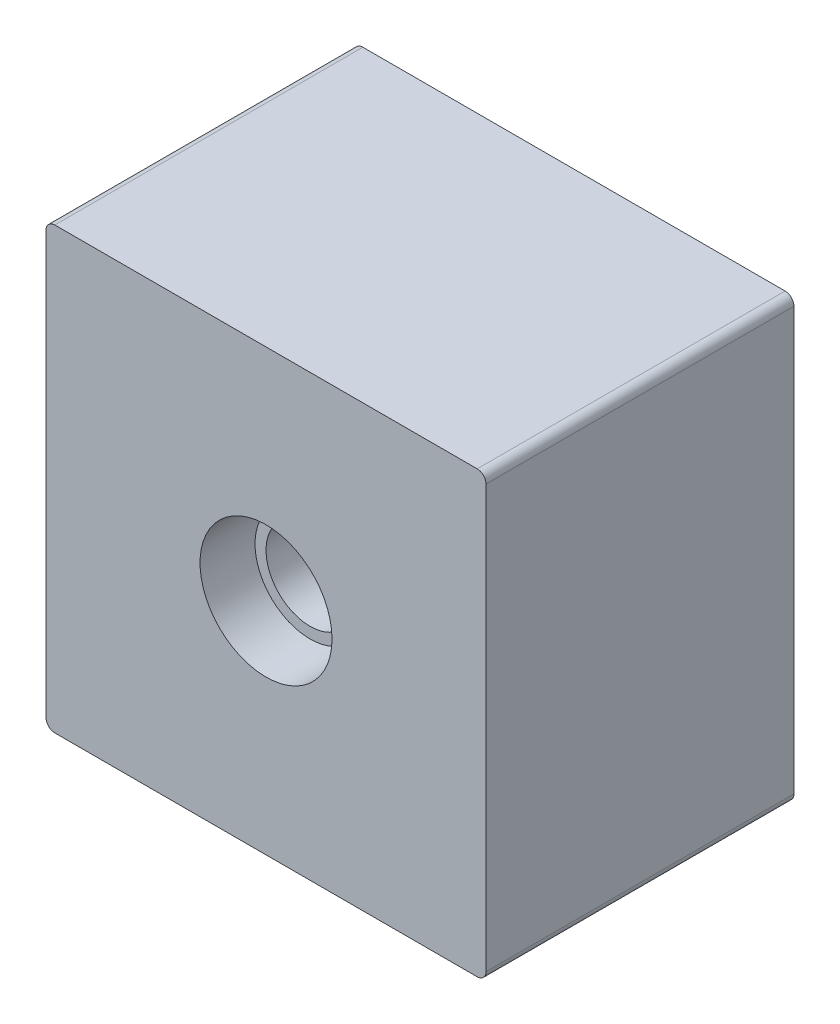
ISO-10303-21;
HEADER;
FILE_DESCRIPTION(('STEP AP214'),'2;1');
FILE_NAME('part.step','',(''),(''),'','','');
FILE_SCHEMA(('AUTOMOTIVE_DESIGN { 1 0 10303 214 1 1 1 1 }'));
ENDSEC;
DATA;
#1=APPLICATION_CONTEXT('core data for automotive mechanical design processes');
#2=APPLICATION_PROTOCOL_DEFINITION('international standard','automotive_design',2000,#1);
#3=PRODUCT_CONTEXT('',#1,'mechanical');
#4=PRODUCT('Part','Part','',(#3));
#5=PRODUCT_RELATED_PRODUCT_CATEGORY('part','',(#4));
#6=PRODUCT_DEFINITION_FORMATION('','',#4);
#7=PRODUCT_DEFINITION_CONTEXT('part definition',#1,'design');
#8=PRODUCT_DEFINITION('design','',#6,#7);
#9=PRODUCT_DEFINITION_SHAPE('','',#8);
#10=(LENGTH_UNIT() NAMED_UNIT(*) SI_UNIT(.MILLI.,.METRE.));
#11=(NAMED_UNIT(*) PLANE_ANGLE_UNIT() SI_UNIT($,.RADIAN.));
#12=(NAMED_UNIT(*) SI_UNIT($,.STERADIAN.) SOLID_ANGLE_UNIT());
#13=UNCERTAINTY_MEASURE_WITH_UNIT(LENGTH_MEASURE(1.E-05),#10,'distance_accuracy_value','');
#14=(GEOMETRIC_REPRESENTATION_CONTEXT(3) GLOBAL_UNCERTAINTY_ASSIGNED_CONTEXT((#13)) GLOBAL_UNIT_ASSIGNED_CONTEXT((#10,
#11,#12)) REPRESENTATION_CONTEXT('',''));
#15=CARTESIAN_POINT('',(0.,0.,0.));
#16=DIRECTION('',(0.,0.,1.));
#17=DIRECTION('',(1.,0.,0.));
#18=AXIS2_PLACEMENT_3D('',#15,#16,#17);
#19=CARTESIAN_POINT('',(-1.38777878078145E-13,0.,5.));
#20=DIRECTION('',(0.,0.,1.00000000000001));
#21=DIRECTION('',(0.913545457642609,-0.406736643075791,0.));
#22=AXIS2_PLACEMENT_3D('',#19,#20,#21);
#23=PLANE('',#22);
#24=CARTESIAN_POINT('',(-1.38777878078145E-13,0.,5.));
#25=DIRECTION('',(0.,0.,-1.00000000000001));
#26=DIRECTION('',(0.913545457642609,-0.406736643075791,0.));
#27=AXIS2_PLACEMENT_3D('',#24,#25,#26);
#28=CIRCLE('',#27,0.5);
#29=CARTESIAN_POINT('',(0.120894803534069,0.485164349966531,4.99999999999987));
#30=VERTEX_POINT('',#29);
#31=CARTESIAN_POINT('',(0.279652962989249,0.414480663350328,4.99999999999995));
#32=VERTEX_POINT('',#31);
#33=EDGE_CURVE('E60',#30,#32,#28,.T.);
#34=ORIENTED_EDGE('',*,*,#33,.T.);
#35=DIRECTION('',(0.559305925978558,0.828961326700635,0.));
#36=VECTOR('',#35,1.);
#37=CARTESIAN_POINT('',(0.279652962989249,0.414480663350328,4.99999999999995));
#38=LINE('',#37,#36);
#39=CARTESIAN_POINT('',(0.559305925978526,0.828961326700635,4.99999999999992));
#40=VERTEX_POINT('',#39);
#41=EDGE_CURVE('E71',#32,#40,#38,.T.);
#42=ORIENTED_EDGE('',*,*,#41,.T.);
#43=CARTESIAN_POINT('',(-1.38777878078145E-13,0.,5.));
#44=DIRECTION('',(0.,0.,1.00000000000001));
#45=DIRECTION('',(0.913545457642609,-0.406736643075791,0.));
#46=AXIS2_PLACEMENT_3D('',#43,#44,#45);
#47=CIRCLE('',#46,1.);
#48=CARTESIAN_POINT('',(0.241789607068277,0.970328699933118,4.99999999999998));
#49=VERTEX_POINT('',#48);
#50=EDGE_CURVE('E56',#40,#49,#47,.T.);
#51=ORIENTED_EDGE('',*,*,#50,.T.);
#52=DIRECTION('',(-0.241789607068291,-0.970328699933056,0.));
#53=VECTOR('',#52,1.);
#54=CARTESIAN_POINT('',(0.120894803534069,0.485164349966531,4.99999999999987));
#55=LINE('',#54,#53);
#56=EDGE_CURVE('E12',#49,#30,#55,.T.);
#57=ORIENTED_EDGE('',*,*,#56,.T.);
#58=EDGE_LOOP('',(#34,#42,#51,#57));
#59=FACE_BOUND('',#58,.T.);
#60=ADVANCED_FACE('F51',(#59),#23,.T.);
#61=OPEN_SHELL('',(#60));
#62=SHELL_BASED_SURFACE_MODEL('B2',(#61));
#63=CARTESIAN_POINT('',(-1.38777878078145E-13,0.,5.));
#64=DIRECTION('',(0.,0.,1.00000000000001));
#65=DIRECTION('',(0.669130606358868,-0.74314482547739,0.));
#66=AXIS2_PLACEMENT_3D('',#63,#64,#65);
#67=PLANE('',#66);
#68=CARTESIAN_POINT('',(-1.38777878078145E-13,0.,5.));
#69=DIRECTION('',(0.,0.,-1.00000000000001));
#70=DIRECTION('',(0.669130606358868,-0.74314482547739,0.));
#71=AXIS2_PLACEMENT_3D('',#68,#69,#70);
#72=CIRCLE('',#71,0.5);
#73=CARTESIAN_POINT('',(0.307777017666655,0.394047341567262,5.));
#74=VERTEX_POINT('',#73);
#75=CARTESIAN_POINT('',(0.424060167686008,0.264901819891979,4.99999999999998));
#76=VERTEX_POINT('',#75);
#77=EDGE_CURVE('E116',#74,#76,#72,.T.);
#78=ORIENTED_EDGE('',*,*,#77,.T.);
#79=DIRECTION('',(0.848120335372177,0.529803639783827,0.));
#80=VECTOR('',#79,1.);
#81=CARTESIAN_POINT('',(0.424060167686008,0.264901819891979,4.99999999999998));
#82=LINE('',#81,#80);
#83=CARTESIAN_POINT('',(0.848120335372099,0.529803639783895,4.99999999999999));
#84=VERTEX_POINT('',#83);
#85=EDGE_CURVE('E127',#76,#84,#82,.T.);
#86=ORIENTED_EDGE('',*,*,#85,.T.);
#87=CARTESIAN_POINT('',(-1.38777878078145E-13,0.,5.));
#88=DIRECTION('',(0.,0.,1.00000000000001));
#89=DIRECTION('',(0.669130606358868,-0.74314482547739,0.));
#90=AXIS2_PLACEMENT_3D('',#87,#88,#89);
#91=CIRCLE('',#90,1.);
#92=CARTESIAN_POINT('',(0.615554035333268,0.788094683134559,4.99999999999991));
#93=VERTEX_POINT('',#92);
#94=EDGE_CURVE('E112',#84,#93,#91,.T.);
#95=ORIENTED_EDGE('',*,*,#94,.T.);
#96=DIRECTION('',(-0.615554035333302,-0.788094683134518,0.));
#97=VECTOR('',#96,1.);
#98=CARTESIAN_POINT('',(0.307777017666655,0.394047341567262,5.));
#99=LINE('',#98,#97);
#100=EDGE_CURVE('E49',#93,#74,#99,.T.);
#101=ORIENTED_EDGE('',*,*,#100,.T.);
#102=EDGE_LOOP('',(#78,#86,#95,#101));
#103=FACE_BOUND('',#102,.T.);
#104=ADVANCED_FACE('F107',(#103),#67,.T.);
#105=OPEN_SHELL('',(#104));
#106=SHELL_BASED_SURFACE_MODEL('B6',(#105));
#107=CARTESIAN_POINT('',(-1.38777878078145E-13,0.,5.));
#108=DIRECTION('',(0.,0.,1.00000000000001));
#109=DIRECTION('',(0.309016994374958,-0.951056516295154,0.));
#110=AXIS2_PLACEMENT_3D('',#107,#108,#109);
#111=PLANE('',#110);
#112=CARTESIAN_POINT('',(-1.38777878078145E-13,0.,5.));
#113=DIRECTION('',(0.,0.,-1.00000000000001));
#114=DIRECTION('',(0.309016994374958,-0.951056516295154,0.));
#115=AXIS2_PLACEMENT_3D('',#112,#113,#114);
#116=CIRCLE('',#115,0.5);
#117=CARTESIAN_POINT('',(0.44144178937805,0.234795968003326,4.99999999999989));
#118=VERTEX_POINT('',#117);
#119=CARTESIAN_POINT('',(0.495143516924285,0.0695190452167406,4.99999999999973));
#120=VERTEX_POINT('',#119);
#121=EDGE_CURVE('E172',#118,#120,#116,.T.);
#122=ORIENTED_EDGE('',*,*,#121,.T.);
#123=DIRECTION('',(0.990287033848586,0.139038090433429,0.));
#124=VECTOR('',#123,1.);
#125=CARTESIAN_POINT('',(0.495143516924285,0.0695190452167406,4.99999999999973));
#126=LINE('',#125,#124);
#127=CARTESIAN_POINT('',(0.990287033848569,0.139038090433495,4.99999999999992));
#128=VERTEX_POINT('',#127);
#129=EDGE_CURVE('E183',#120,#128,#126,.T.);
#130=ORIENTED_EDGE('',*,*,#129,.T.);
#131=CARTESIAN_POINT('',(-1.38777878078145E-13,0.,5.));
#132=DIRECTION('',(0.,0.,1.00000000000001));
#133=DIRECTION('',(0.309016994374958,-0.951056516295154,0.));
#134=AXIS2_PLACEMENT_3D('',#131,#132,#133);
#135=CIRCLE('',#134,1.);
#136=CARTESIAN_POINT('',(0.882883578756322,0.4695919360066,4.99999999999998));
#137=VERTEX_POINT('',#136);
#138=EDGE_CURVE('E168',#128,#137,#135,.T.);
#139=ORIENTED_EDGE('',*,*,#138,.T.);
#140=DIRECTION('',(-0.88288357875633,-0.469591936006592,0.));
#141=VECTOR('',#140,1.);
#142=CARTESIAN_POINT('',(0.44144178937805,0.234795968003326,4.99999999999989));
#143=LINE('',#142,#141);
#144=EDGE_CURVE('E105',#137,#118,#143,.T.);
#145=ORIENTED_EDGE('',*,*,#144,.T.);
#146=EDGE_LOOP('',(#122,#130,#139,#145));
#147=FACE_BOUND('',#146,.T.);
#148=ADVANCED_FACE('F163',(#147),#111,.T.);
#149=OPEN_SHELL('',(#148));
#150=SHELL_BASED_SURFACE_MODEL('B43',(#149));
#151=CARTESIAN_POINT('',(-1.38777878078145E-13,0.,5.));
#152=DIRECTION('',(0.,0.,1.00000000000001));
#153=DIRECTION('',(-0.104528463267644,-0.99452189536828,0.));
#154=AXIS2_PLACEMENT_3D('',#151,#152,#153);
#155=PLANE('',#154);
#156=CARTESIAN_POINT('',(-1.38777878078145E-13,0.,5.));
#157=DIRECTION('',(0.,0.,-1.00000000000001));
#158=DIRECTION('',(-0.104528463267644,-0.99452189536828,0.));
#159=AXIS2_PLACEMENT_3D('',#156,#157,#158);
#160=CIRCLE('',#159,0.5);
#161=CARTESIAN_POINT('',(0.498777265333317,0.0349462385172139,4.99999999999989));
#162=VERTEX_POINT('',#161);
#163=CARTESIAN_POINT('',(0.480612053848653,-0.137884203937143,5.));
#164=VERTEX_POINT('',#163);
#165=EDGE_CURVE('E228',#162,#164,#160,.T.);
#166=ORIENTED_EDGE('',*,*,#165,.T.);
#167=DIRECTION('',(0.961224107697303,-0.275768407874307,0.));
#168=VECTOR('',#167,1.);
#169=CARTESIAN_POINT('',(0.480612053848653,-0.137884203937143,5.));
#170=LINE('',#169,#168);
#171=CARTESIAN_POINT('',(0.961224107697195,-0.275768407874306,5.));
#172=VERTEX_POINT('',#171);
#173=EDGE_CURVE('E239',#164,#172,#170,.T.);
#174=ORIENTED_EDGE('',*,*,#173,.T.);
#175=CARTESIAN_POINT('',(-1.38777878078145E-13,0.,5.));
#176=DIRECTION('',(0.,0.,1.00000000000001));
#177=DIRECTION('',(-0.104528463267644,-0.99452189536828,0.));
#178=AXIS2_PLACEMENT_3D('',#175,#176,#177);
#179=CIRCLE('',#178,1.);
#180=CARTESIAN_POINT('',(0.997554530666814,0.0698924770343168,4.99999999999988));
#181=VERTEX_POINT('',#180);
#182=EDGE_CURVE('E224',#172,#181,#179,.T.);
#183=ORIENTED_EDGE('',*,*,#182,.T.);
#184=DIRECTION('',(-0.997554530666877,-0.0698924770343165,0.));
#185=VECTOR('',#184,1.);
#186=CARTESIAN_POINT('',(0.498777265333317,0.0349462385172139,4.99999999999989));
#187=LINE('',#186,#185);
#188=EDGE_CURVE('E161',#181,#162,#187,.T.);
#189=ORIENTED_EDGE('',*,*,#188,.T.);
#190=EDGE_LOOP('',(#166,#174,#183,#189));
#191=FACE_BOUND('',#190,.T.);
#192=ADVANCED_FACE('F219',(#191),#155,.T.);
#193=OPEN_SHELL('',(#192));
#194=SHELL_BASED_SURFACE_MODEL('B99',(#193));
#195=CARTESIAN_POINT('',(-1.38777878078145E-13,0.,5.));
#196=DIRECTION('',(0.,0.,1.00000000000001));
#197=DIRECTION('',(-0.499999999999993,-0.866025403784448,0.));
#198=AXIS2_PLACEMENT_3D('',#195,#196,#197);
#199=PLANE('',#198);
#200=CARTESIAN_POINT('',(-1.38777878078145E-13,0.,5.));
#201=DIRECTION('',(0.,0.,-1.00000000000001));
#202=DIRECTION('',(-0.499999999999993,-0.866025403784448,0.));
#203=AXIS2_PLACEMENT_3D('',#200,#201,#202);
#204=CIRCLE('',#203,0.5);
#205=CARTESIAN_POINT('',(0.469869620863345,-0.170946013085205,5.));
#206=VERTEX_POINT('',#205);
#207=CARTESIAN_POINT('',(0.382978400439035,-0.321446021591586,4.99999999999977));
#208=VERTEX_POINT('',#207);
#209=EDGE_CURVE('E284',#206,#208,#204,.T.);
#210=ORIENTED_EDGE('',*,*,#209,.T.);
#211=DIRECTION('',(0.765956800878279,-0.642892043183239,0.));
#212=VECTOR('',#211,1.);
#213=CARTESIAN_POINT('',(0.382978400439035,-0.321446021591586,4.99999999999977));
#214=LINE('',#213,#212);
#215=CARTESIAN_POINT('',(0.765956800878155,-0.642892043183234,5.));
#216=VERTEX_POINT('',#215);
#217=EDGE_CURVE('E295',#208,#216,#214,.T.);
#218=ORIENTED_EDGE('',*,*,#217,.T.);
#219=CARTESIAN_POINT('',(-1.38777878078145E-13,0.,5.));
#220=DIRECTION('',(0.,0.,1.00000000000001));
#221=DIRECTION('',(-0.499999999999993,-0.866025403784448,0.));
#222=AXIS2_PLACEMENT_3D('',#219,#220,#221);
#223=CIRCLE('',#222,1.);
#224=CARTESIAN_POINT('',(0.939739241726578,-0.341892026170354,4.99999999999991));
#225=VERTEX_POINT('',#224);
#226=EDGE_CURVE('E280',#216,#225,#223,.T.);
#227=ORIENTED_EDGE('',*,*,#226,.T.);
#228=DIRECTION('',(-0.939739241726713,0.341892026170413,0.));
#229=VECTOR('',#228,1.);
#230=CARTESIAN_POINT('',(0.469869620863345,-0.170946013085205,5.));
#231=LINE('',#230,#229);
#232=EDGE_CURVE('E217',#225,#206,#231,.T.);
#233=ORIENTED_EDGE('',*,*,#232,.T.);
#234=EDGE_LOOP('',(#210,#218,#227,#233));
#235=FACE_BOUND('',#234,.T.);
#236=ADVANCED_FACE('F275',(#235),#199,.T.);
#237=OPEN_SHELL('',(#236));
#238=SHELL_BASED_SURFACE_MODEL('B155',(#237));
#239=CARTESIAN_POINT('',(-1.38777878078145E-13,0.,5.));
#240=DIRECTION('',(0.,0.,1.00000000000001));
#241=DIRECTION('',(-0.809016994374944,-0.587785252292482,0.));
#242=AXIS2_PLACEMENT_3D('',#239,#240,#241);
#243=PLANE('',#242);
#244=CARTESIAN_POINT('',(-1.38777878078145E-13,0.,5.));
#245=DIRECTION('',(0.,0.,-1.00000000000001));
#246=DIRECTION('',(-0.809016994374944,-0.587785252292482,0.));
#247=AXIS2_PLACEMENT_3D('',#244,#245,#246);
#248=CIRCLE('',#247,0.5);
#249=CARTESIAN_POINT('',(0.359717250314417,-0.347280146029319,4.99999999999981));
#250=VERTEX_POINT('',#249);
#251=CARTESIAN_POINT('',(0.21912430234404,-0.449426901867431,4.99999999999995));
#252=VERTEX_POINT('',#251);
#253=EDGE_CURVE('E340',#250,#252,#248,.T.);
#254=ORIENTED_EDGE('',*,*,#253,.T.);
#255=DIRECTION('',(0.438248604688317,-0.89885380373493,0.));
#256=VECTOR('',#255,1.);
#257=CARTESIAN_POINT('',(0.21912430234404,-0.449426901867431,4.99999999999995));
#258=LINE('',#257,#256);
#259=CARTESIAN_POINT('',(0.438248604688302,-0.898853803734882,4.99999999999973));
#260=VERTEX_POINT('',#259);
#261=EDGE_CURVE('E351',#252,#260,#258,.T.);
#262=ORIENTED_EDGE('',*,*,#261,.T.);
#263=CARTESIAN_POINT('',(-1.38777878078145E-13,0.,5.));
#264=DIRECTION('',(0.,0.,1.00000000000001));
#265=DIRECTION('',(-0.809016994374944,-0.587785252292482,0.));
#266=AXIS2_PLACEMENT_3D('',#263,#264,#265);
#267=CIRCLE('',#266,1.);
#268=CARTESIAN_POINT('',(0.719434500629001,-0.694560292058721,5.));
#269=VERTEX_POINT('',#268);
#270=EDGE_CURVE('E336',#260,#269,#267,.T.);
#271=ORIENTED_EDGE('',*,*,#270,.T.);
#272=DIRECTION('',(-0.719434500629001,0.694560292058728,0.));
#273=VECTOR('',#272,1.);
#274=CARTESIAN_POINT('',(0.359717250314417,-0.347280146029319,4.99999999999981));
#275=LINE('',#274,#273);
#276=EDGE_CURVE('E273',#269,#250,#275,.T.);
#277=ORIENTED_EDGE('',*,*,#276,.T.);
#278=EDGE_LOOP('',(#254,#262,#271,#277));
#279=FACE_BOUND('',#278,.T.);
#280=ADVANCED_FACE('F331',(#279),#243,.T.);
#281=OPEN_SHELL('',(#280));
#282=SHELL_BASED_SURFACE_MODEL('B211',(#281));
#283=CARTESIAN_POINT('',(-1.38777878078145E-13,0.,5.));
#284=DIRECTION('',(0.,0.,1.00000000000001));
#285=DIRECTION('',(-0.978147600733807,-0.207911690817767,0.));
#286=AXIS2_PLACEMENT_3D('',#283,#284,#285);
#287=PLANE('',#286);
#288=CARTESIAN_POINT('',(-1.38777878078145E-13,0.,5.));
#289=DIRECTION('',(0.,0.,-1.00000000000001));
#290=DIRECTION('',(-0.978147600733807,-0.207911690817767,0.));
#291=AXIS2_PLACEMENT_3D('',#288,#289,#290);
#292=CIRCLE('',#291,0.5);
#293=CARTESIAN_POINT('',(0.18736649925763,-0.463566386783961,4.99999999999998));
#294=VERTEX_POINT('',#293);
#295=CARTESIAN_POINT('',(0.0173816216920697,-0.499697787895121,4.99999999999989));
#296=VERTEX_POINT('',#295);
#297=EDGE_CURVE('E396',#294,#296,#292,.T.);
#298=ORIENTED_EDGE('',*,*,#297,.T.);
#299=DIRECTION('',(0.0347632433841603,-0.9993955757904,0.));
#300=VECTOR('',#299,1.);
#301=CARTESIAN_POINT('',(0.0173816216920697,-0.499697787895121,4.99999999999989));
#302=LINE('',#301,#300);
#303=CARTESIAN_POINT('',(0.03476324338407,-0.999395575790322,4.99999999999975));
#304=VERTEX_POINT('',#303);
#305=EDGE_CURVE('E407',#296,#304,#302,.T.);
#306=ORIENTED_EDGE('',*,*,#305,.T.);
#307=CARTESIAN_POINT('',(-1.38777878078145E-13,0.,5.));
#308=DIRECTION('',(0.,0.,1.00000000000001));
#309=DIRECTION('',(-0.978147600733807,-0.207911690817767,0.));
#310=AXIS2_PLACEMENT_3D('',#307,#308,#309);
#311=CIRCLE('',#310,1.);
#312=CARTESIAN_POINT('',(0.374732998515162,-0.927132773567853,4.99999999999998));
#313=VERTEX_POINT('',#312);
#314=EDGE_CURVE('E392',#304,#313,#311,.T.);
#315=ORIENTED_EDGE('',*,*,#314,.T.);
#316=DIRECTION('',(-0.374732998515283,0.927132773567926,0.));
#317=VECTOR('',#316,1.);
#318=CARTESIAN_POINT('',(0.18736649925763,-0.463566386783961,4.99999999999998));
#319=LINE('',#318,#317);
#320=EDGE_CURVE('E329',#313,#294,#319,.T.);
#321=ORIENTED_EDGE('',*,*,#320,.T.);
#322=EDGE_LOOP('',(#298,#306,#315,#321));
#323=FACE_BOUND('',#322,.T.);
#324=ADVANCED_FACE('F387',(#323),#287,.T.);
#325=OPEN_SHELL('',(#324));
#326=SHELL_BASED_SURFACE_MODEL('B267',(#325));
#327=CARTESIAN_POINT('',(-1.38777878078145E-13,0.,5.));
#328=DIRECTION('',(0.,0.,1.00000000000001));
#329=DIRECTION('',(-0.978147600733809,0.207911690817754,0.));
#330=AXIS2_PLACEMENT_3D('',#327,#328,#329);
#331=PLANE('',#330);
#332=CARTESIAN_POINT('',(-1.38777878078145E-13,0.,5.));
#333=DIRECTION('',(0.,0.,-1.00000000000001));
#334=DIRECTION('',(-0.978147600733809,0.207911690817754,0.));
#335=AXIS2_PLACEMENT_3D('',#332,#333,#334);
#336=CIRCLE('',#335,0.5);
#337=CARTESIAN_POINT('',(-0.017381621692068,-0.499697787895124,4.99999999999991));
#338=VERTEX_POINT('',#337);
#339=CARTESIAN_POINT('',(-0.187366499257656,-0.463566386783895,4.99999999999998));
#340=VERTEX_POINT('',#339);
#341=EDGE_CURVE('E452',#338,#340,#336,.T.);
#342=ORIENTED_EDGE('',*,*,#341,.T.);
#343=DIRECTION('',(-0.374732998515269,-0.92713277356793,0.));
#344=VECTOR('',#343,1.);
#345=CARTESIAN_POINT('',(-0.187366499257656,-0.463566386783895,4.99999999999998));
#346=LINE('',#345,#344);
#347=CARTESIAN_POINT('',(-0.374732998515285,-0.92713277356786,5.));
#348=VERTEX_POINT('',#347);
#349=EDGE_CURVE('E463',#340,#348,#346,.T.);
#350=ORIENTED_EDGE('',*,*,#349,.T.);
#351=CARTESIAN_POINT('',(-1.38777878078145E-13,0.,5.));
#352=DIRECTION('',(0.,0.,1.00000000000001));
#353=DIRECTION('',(-0.978147600733809,0.207911690817754,0.));
#354=AXIS2_PLACEMENT_3D('',#351,#352,#353);
#355=CIRCLE('',#354,1.);
#356=CARTESIAN_POINT('',(-0.0347632433842348,-0.999395575790318,4.99999999999971));
#357=VERTEX_POINT('',#356);
#358=EDGE_CURVE('E448',#348,#357,#355,.T.);
#359=ORIENTED_EDGE('',*,*,#358,.T.);
#360=DIRECTION('',(0.0347632433841459,0.9993955757904,0.));
#361=VECTOR('',#360,1.);
#362=CARTESIAN_POINT('',(-0.017381621692068,-0.499697787895124,4.99999999999991));
#363=LINE('',#362,#361);
#364=EDGE_CURVE('E385',#357,#338,#363,.T.);
#365=ORIENTED_EDGE('',*,*,#364,.T.);
#366=EDGE_LOOP('',(#342,#350,#359,#365));
#367=FACE_BOUND('',#366,.T.);
#368=ADVANCED_FACE('F443',(#367),#331,.T.);
#369=OPEN_SHELL('',(#368));
#370=SHELL_BASED_SURFACE_MODEL('B323',(#369));
#371=CARTESIAN_POINT('',(-1.38777878078145E-13,0.,5.));
#372=DIRECTION('',(0.,0.,1.00000000000001));
#373=DIRECTION('',(-0.809016994374953,0.587785252292472,0.));
#374=AXIS2_PLACEMENT_3D('',#371,#372,#373);
#375=PLANE('',#374);
#376=CARTESIAN_POINT('',(-1.38777878078145E-13,0.,5.));
#377=DIRECTION('',(0.,0.,-1.00000000000001));
#378=DIRECTION('',(-0.809016994374953,0.587785252292472,0.));
#379=AXIS2_PLACEMENT_3D('',#376,#377,#378);
#380=CIRCLE('',#379,0.5);
#381=CARTESIAN_POINT('',(-0.219124302344163,-0.449426901867424,4.99999999999998));
#382=VERTEX_POINT('',#381);
#383=CARTESIAN_POINT('',(-0.359717250314556,-0.347280146029326,4.99999999999982));
#384=VERTEX_POINT('',#383);
#385=EDGE_CURVE('E508',#382,#384,#380,.T.);
#386=ORIENTED_EDGE('',*,*,#385,.T.);
#387=DIRECTION('',(-0.719434500628993,-0.694560292058739,0.));
#388=VECTOR('',#387,1.);
#389=CARTESIAN_POINT('',(-0.359717250314556,-0.347280146029326,4.99999999999982));
#390=LINE('',#389,#388);
#391=CARTESIAN_POINT('',(-0.719434500629041,-0.694560292058714,4.99999999999973));
#392=VERTEX_POINT('',#391);
#393=EDGE_CURVE('E519',#384,#392,#390,.T.);
#394=ORIENTED_EDGE('',*,*,#393,.T.);
#395=CARTESIAN_POINT('',(-1.38777878078145E-13,0.,5.));
#396=DIRECTION('',(0.,0.,1.00000000000001));
#397=DIRECTION('',(-0.809016994374953,0.587785252292472,0.));
#398=AXIS2_PLACEMENT_3D('',#395,#396,#397);
#399=CIRCLE('',#398,1.);
#400=CARTESIAN_POINT('',(-0.4382486046883,-0.898853803734861,4.99999999999999));
#401=VERTEX_POINT('',#400);
#402=EDGE_CURVE('E504',#392,#401,#399,.T.);
#403=ORIENTED_EDGE('',*,*,#402,.T.);
#404=DIRECTION('',(0.438248604688304,0.898853803734937,0.));
#405=VECTOR('',#404,1.);
#406=CARTESIAN_POINT('',(-0.219124302344163,-0.449426901867424,4.99999999999998));
#407=LINE('',#406,#405);
#408=EDGE_CURVE('E441',#401,#382,#407,.T.);
#409=ORIENTED_EDGE('',*,*,#408,.T.);
#410=EDGE_LOOP('',(#386,#394,#403,#409));
#411=FACE_BOUND('',#410,.T.);
#412=ADVANCED_FACE('F499',(#411),#375,.T.);
#413=OPEN_SHELL('',(#412));
#414=SHELL_BASED_SURFACE_MODEL('B379',(#413));
#415=CARTESIAN_POINT('',(-1.38777878078145E-13,0.,5.));
#416=DIRECTION('',(0.,0.,1.00000000000001));
#417=DIRECTION('',(-0.500000000000006,0.86602540378444,0.));
#418=AXIS2_PLACEMENT_3D('',#415,#416,#417);
#419=PLANE('',#418);
#420=CARTESIAN_POINT('',(-1.38777878078145E-13,0.,5.));
#421=DIRECTION('',(0.,0.,-1.00000000000001));
#422=DIRECTION('',(-0.500000000000006,0.86602540378444,0.));
#423=AXIS2_PLACEMENT_3D('',#420,#421,#422);
#424=CIRCLE('',#423,0.5);
#425=CARTESIAN_POINT('',(-0.382978400439202,-0.321446021591593,4.99999999999988));
#426=VERTEX_POINT('',#425);
#427=CARTESIAN_POINT('',(-0.469869620863345,-0.170946013085212,4.99999999999998));
#428=VERTEX_POINT('',#427);
#429=EDGE_CURVE('E564',#426,#428,#424,.T.);
#430=ORIENTED_EDGE('',*,*,#429,.T.);
#431=DIRECTION('',(-0.939739241726706,-0.341892026170427,0.));
#432=VECTOR('',#431,1.);
#433=CARTESIAN_POINT('',(-0.469869620863345,-0.170946013085212,4.99999999999998));
#434=LINE('',#433,#432);
#435=CARTESIAN_POINT('',(-0.939739241726731,-0.341892026170361,4.99999999999992));
#436=VERTEX_POINT('',#435);
#437=EDGE_CURVE('E575',#428,#436,#434,.T.);
#438=ORIENTED_EDGE('',*,*,#437,.T.);
#439=CARTESIAN_POINT('',(-1.38777878078145E-13,0.,5.));
#440=DIRECTION('',(0.,0.,1.00000000000001));
#441=DIRECTION('',(-0.500000000000006,0.86602540378444,0.));
#442=AXIS2_PLACEMENT_3D('',#439,#440,#441);
#443=CIRCLE('',#442,1.);
#444=CARTESIAN_POINT('',(-0.765956800878332,-0.642892043183213,4.99999999999978));
#445=VERTEX_POINT('',#444);
#446=EDGE_CURVE('E560',#436,#445,#443,.T.);
#447=ORIENTED_EDGE('',*,*,#446,.T.);
#448=DIRECTION('',(0.765956800878271,0.64289204318325,0.));
#449=VECTOR('',#448,1.);
#450=CARTESIAN_POINT('',(-0.382978400439202,-0.321446021591593,4.99999999999988));
#451=LINE('',#450,#449);
#452=EDGE_CURVE('E497',#445,#426,#451,.T.);
#453=ORIENTED_EDGE('',*,*,#452,.T.);
#454=EDGE_LOOP('',(#430,#438,#447,#453));
#455=FACE_BOUND('',#454,.T.);
#456=ADVANCED_FACE('F555',(#455),#419,.T.);
#457=OPEN_SHELL('',(#456));
#458=SHELL_BASED_SURFACE_MODEL('B435',(#457));
#459=CARTESIAN_POINT('',(-1.38777878078145E-13,0.,5.));
#460=DIRECTION('',(0.,0.,1.00000000000001));
#461=DIRECTION('',(-0.104528463267657,0.994521895368278,0.));
#462=AXIS2_PLACEMENT_3D('',#459,#460,#461);
#463=PLANE('',#462);
#464=CARTESIAN_POINT('',(-1.38777878078145E-13,0.,5.));
#465=DIRECTION('',(0.,0.,-1.00000000000001));
#466=DIRECTION('',(-0.104528463267657,0.994521895368278,0.));
#467=AXIS2_PLACEMENT_3D('',#464,#465,#466);
#468=CIRCLE('',#467,0.5);
#469=CARTESIAN_POINT('',(-0.480612053848667,-0.137884203937066,4.99999999999995));
#470=VERTEX_POINT('',#469);
#471=CARTESIAN_POINT('',(-0.498777265333511,0.0349462385172208,4.99999999999989));
#472=VERTEX_POINT('',#471);
#473=EDGE_CURVE('E620',#470,#472,#468,.T.);
#474=ORIENTED_EDGE('',*,*,#473,.T.);
#475=DIRECTION('',(-0.997554530666878,0.0698924770343019,0.));
#476=VECTOR('',#475,1.);
#477=CARTESIAN_POINT('',(-0.498777265333511,0.0349462385172208,4.99999999999989));
#478=LINE('',#477,#476);
#479=CARTESIAN_POINT('',(-0.997554530666883,0.0698924770343029,4.99999999999998));
#480=VERTEX_POINT('',#479);
#481=EDGE_CURVE('E631',#472,#480,#478,.T.);
#482=ORIENTED_EDGE('',*,*,#481,.T.);
#483=CARTESIAN_POINT('',(-1.38777878078145E-13,0.,5.));
#484=DIRECTION('',(0.,0.,1.00000000000001));
#485=DIRECTION('',(-0.104528463267657,0.994521895368278,0.));
#486=AXIS2_PLACEMENT_3D('',#483,#484,#485);
#487=CIRCLE('',#486,1.);
#488=CARTESIAN_POINT('',(-0.961224107697431,-0.275768407874313,5.));
#489=VERTEX_POINT('',#488);
#490=EDGE_CURVE('E616',#480,#489,#487,.T.);
#491=ORIENTED_EDGE('',*,*,#490,.T.);
#492=DIRECTION('',(0.961224107697298,0.27576840787432,0.));
#493=VECTOR('',#492,1.);
#494=CARTESIAN_POINT('',(-0.480612053848667,-0.137884203937066,4.99999999999995));
#495=LINE('',#494,#493);
#496=EDGE_CURVE('E553',#489,#470,#495,.T.);
#497=ORIENTED_EDGE('',*,*,#496,.T.);
#498=EDGE_LOOP('',(#474,#482,#491,#497));
#499=FACE_BOUND('',#498,.T.);
#500=ADVANCED_FACE('F611',(#499),#463,.T.);
#501=OPEN_SHELL('',(#500));
#502=SHELL_BASED_SURFACE_MODEL('B491',(#501));
#503=CARTESIAN_POINT('',(-1.38777878078145E-13,0.,5.));
#504=DIRECTION('',(0.,0.,1.00000000000001));
#505=DIRECTION('',(0.309016994374946,0.95105651629516,0.));
#506=AXIS2_PLACEMENT_3D('',#503,#504,#505);
#507=PLANE('',#506);
#508=CARTESIAN_POINT('',(-1.38777878078145E-13,0.,5.));
#509=DIRECTION('',(0.,0.,-1.00000000000001));
#510=DIRECTION('',(0.309016994374946,0.95105651629516,0.));
#511=AXIS2_PLACEMENT_3D('',#508,#509,#510);
#512=CIRCLE('',#511,0.5);
#513=CARTESIAN_POINT('',(-0.495143516924354,0.0695190452167233,4.99999999999978));
#514=VERTEX_POINT('',#513);
#515=CARTESIAN_POINT('',(-0.441441789378202,0.234795968003319,4.99999999999987));
#516=VERTEX_POINT('',#515);
#517=EDGE_CURVE('E676',#514,#516,#512,.T.);
#518=ORIENTED_EDGE('',*,*,#517,.T.);
#519=DIRECTION('',(-0.882883578756338,0.469591936006579,0.));
#520=VECTOR('',#519,1.);
#521=CARTESIAN_POINT('',(-0.441441789378202,0.234795968003319,4.99999999999987));
#522=LINE('',#521,#520);
#523=CARTESIAN_POINT('',(-0.882883578756377,0.469591936006646,4.99999999999995));
#524=VERTEX_POINT('',#523);
#525=EDGE_CURVE('E687',#516,#524,#522,.T.);
#526=ORIENTED_EDGE('',*,*,#525,.T.);
#527=CARTESIAN_POINT('',(-1.38777878078145E-13,0.,5.));
#528=DIRECTION('',(0.,0.,1.00000000000001));
#529=DIRECTION('',(0.309016994374946,0.95105651629516,0.));
#530=AXIS2_PLACEMENT_3D('',#527,#528,#529);
#531=CIRCLE('',#530,1.);
#532=CARTESIAN_POINT('',(-0.990287033848597,0.139038090433426,4.99999999999995));
#533=VERTEX_POINT('',#532);
#534=EDGE_CURVE('E672',#524,#533,#531,.T.);
#535=ORIENTED_EDGE('',*,*,#534,.T.);
#536=DIRECTION('',(0.990287033848588,-0.139038090433415,0.));
#537=VECTOR('',#536,1.);
#538=CARTESIAN_POINT('',(-0.495143516924354,0.0695190452167233,4.99999999999978));
#539=LINE('',#538,#537);
#540=EDGE_CURVE('E609',#533,#514,#539,.T.);
#541=ORIENTED_EDGE('',*,*,#540,.T.);
#542=EDGE_LOOP('',(#518,#526,#535,#541));
#543=FACE_BOUND('',#542,.T.);
#544=ADVANCED_FACE('F667',(#543),#507,.T.);
#545=OPEN_SHELL('',(#544));
#546=SHELL_BASED_SURFACE_MODEL('B547',(#545));
#547=CARTESIAN_POINT('',(-1.38777878078145E-13,0.,5.));
#548=DIRECTION('',(0.,0.,1.00000000000001));
#549=DIRECTION('',(0.669130606358859,0.743144825477399,0.));
#550=AXIS2_PLACEMENT_3D('',#547,#548,#549);
#551=PLANE('',#550);
#552=CARTESIAN_POINT('',(-1.38777878078145E-13,0.,5.));
#553=DIRECTION('',(0.,0.,-1.00000000000001));
#554=DIRECTION('',(0.669130606358859,0.743144825477399,0.));
#555=AXIS2_PLACEMENT_3D('',#552,#553,#554);
#556=CIRCLE('',#555,0.5);
#557=CARTESIAN_POINT('',(-0.424060167686091,0.264901819891972,4.99999999999998));
#558=VERTEX_POINT('',#557);
#559=CARTESIAN_POINT('',(-0.307777017666655,0.394047341567255,5.));
#560=VERTEX_POINT('',#559);
#561=EDGE_CURVE('E732',#558,#560,#556,.T.);
#562=ORIENTED_EDGE('',*,*,#561,.T.);
#563=DIRECTION('',(-0.615554035333313,0.788094683134508,0.));
#564=VECTOR('',#563,1.);
#565=CARTESIAN_POINT('',(-0.307777017666655,0.394047341567255,5.));
#566=LINE('',#565,#564);
#567=CARTESIAN_POINT('',(-0.615554035333421,0.788094683134538,4.99999999999984));
#568=VERTEX_POINT('',#567);
#569=EDGE_CURVE('E743',#560,#568,#566,.T.);
#570=ORIENTED_EDGE('',*,*,#569,.T.);
#571=CARTESIAN_POINT('',(-1.38777878078145E-13,0.,5.));
#572=DIRECTION('',(0.,0.,1.00000000000001));
#573=DIRECTION('',(0.669130606358859,0.743144825477399,0.));
#574=AXIS2_PLACEMENT_3D('',#571,#572,#573);
#575=CIRCLE('',#574,1.);
#576=CARTESIAN_POINT('',(-0.848120335372196,0.529803639783881,4.99999999999994));
#577=VERTEX_POINT('',#576);
#578=EDGE_CURVE('E728',#568,#577,#575,.T.);
#579=ORIENTED_EDGE('',*,*,#578,.T.);
#580=DIRECTION('',(0.848120335372186,-0.529803639783816,0.));
#581=VECTOR('',#580,1.);
#582=CARTESIAN_POINT('',(-0.424060167686091,0.264901819891972,4.99999999999998));
#583=LINE('',#582,#581);
#584=EDGE_CURVE('E665',#577,#558,#583,.T.);
#585=ORIENTED_EDGE('',*,*,#584,.T.);
#586=EDGE_LOOP('',(#562,#570,#579,#585));
#587=FACE_BOUND('',#586,.T.);
#588=ADVANCED_FACE('F723',(#587),#551,.T.);
#589=OPEN_SHELL('',(#588));
#590=SHELL_BASED_SURFACE_MODEL('B603',(#589));
#591=CARTESIAN_POINT('',(-1.38777878078145E-13,0.,5.));
#592=DIRECTION('',(0.,0.,1.00000000000001));
#593=DIRECTION('',(0.913545457642602,0.406736643075803,0.));
#594=AXIS2_PLACEMENT_3D('',#591,#592,#593);
#595=PLANE('',#594);
#596=CARTESIAN_POINT('',(-1.38777878078145E-13,0.,5.));
#597=DIRECTION('',(0.,0.,-1.00000000000001));
#598=DIRECTION('',(0.913545457642602,0.406736643075803,0.));
#599=AXIS2_PLACEMENT_3D('',#596,#597,#598);
#600=CIRCLE('',#599,0.5);
#601=CARTESIAN_POINT('',(-0.279652962989374,0.414480663350335,4.99999999999973));
#602=VERTEX_POINT('',#601);
#603=CARTESIAN_POINT('',(-0.120894803534166,0.485164349966524,5.));
#604=VERTEX_POINT('',#603);
#605=EDGE_CURVE('E788',#602,#604,#600,.T.);
#606=ORIENTED_EDGE('',*,*,#605,.T.);
#607=DIRECTION('',(-0.241789607068305,0.970328699933051,0.));
#608=VECTOR('',#607,1.);
#609=CARTESIAN_POINT('',(-0.120894803534166,0.485164349966524,5.));
#610=LINE('',#609,#608);
#611=CARTESIAN_POINT('',(-0.241789607068346,0.970328699933114,4.99999999999995));
#612=VERTEX_POINT('',#611);
#613=EDGE_CURVE('E799',#604,#612,#610,.T.);
#614=ORIENTED_EDGE('',*,*,#613,.T.);
#615=CARTESIAN_POINT('',(-1.38777878078145E-13,0.,5.));
#616=DIRECTION('',(0.,0.,1.00000000000001));
#617=DIRECTION('',(0.913545457642602,0.406736643075803,0.));
#618=AXIS2_PLACEMENT_3D('',#615,#616,#617);
#619=CIRCLE('',#618,1.);
#620=CARTESIAN_POINT('',(-0.559305925978582,0.82896132670067,4.99999999999978));
#621=VERTEX_POINT('',#620);
#622=EDGE_CURVE('E784',#612,#621,#619,.T.);
#623=ORIENTED_EDGE('',*,*,#622,.T.);
#624=DIRECTION('',(0.559305925978569,-0.828961326700626,0.));
#625=VECTOR('',#624,1.);
#626=CARTESIAN_POINT('',(-0.279652962989374,0.414480663350335,4.99999999999973));
#627=LINE('',#626,#625);
#628=EDGE_CURVE('E721',#621,#602,#627,.T.);
#629=ORIENTED_EDGE('',*,*,#628,.T.);
#630=EDGE_LOOP('',(#606,#614,#623,#629));
#631=FACE_BOUND('',#630,.T.);
#632=ADVANCED_FACE('F779',(#631),#595,.T.);
#633=OPEN_SHELL('',(#632));
#634=SHELL_BASED_SURFACE_MODEL('B659',(#633));
#635=CARTESIAN_POINT('',(-1.38777878078145E-13,0.,5.));
#636=DIRECTION('',(0.,0.,1.00000000000001));
#637=DIRECTION('',(1.,0.,0.));
#638=AXIS2_PLACEMENT_3D('',#635,#636,#637);
#639=PLANE('',#638);
#640=CARTESIAN_POINT('',(-1.38777878078145E-13,0.,5.));
#641=DIRECTION('',(0.,0.,-1.00000000000001));
#642=DIRECTION('',(1.,0.,0.));
#643=AXIS2_PLACEMENT_3D('',#640,#641,#642);
#644=CIRCLE('',#643,0.5);
#645=CARTESIAN_POINT('',(-0.0868912204242817,0.492392034676881,4.99999999999967));
#646=VERTEX_POINT('',#645);
#647=CARTESIAN_POINT('',(0.0868912204242123,0.492392034676874,4.9999999999997));
#648=VERTEX_POINT('',#647);
#649=EDGE_CURVE('E843',#646,#648,#644,.T.);
#650=ORIENTED_EDGE('',*,*,#649,.T.);
#651=DIRECTION('',(0.173782440848435,0.984784069353668,0.));
#652=VECTOR('',#651,1.);
#653=CARTESIAN_POINT('',(0.0868912204242123,0.492392034676874,4.9999999999997));
#654=LINE('',#653,#652);
#655=CARTESIAN_POINT('',(0.1737824408483,0.984784069353678,4.99999999999995));
#656=VERTEX_POINT('',#655);
#657=EDGE_CURVE('E854',#648,#656,#654,.T.);
#658=ORIENTED_EDGE('',*,*,#657,.T.);
#659=CARTESIAN_POINT('',(-1.38777878078145E-13,0.,5.));
#660=DIRECTION('',(0.,0.,1.00000000000001));
#661=DIRECTION('',(1.,0.,0.));
#662=AXIS2_PLACEMENT_3D('',#659,#660,#661);
#663=CIRCLE('',#662,1.);
#664=CARTESIAN_POINT('',(-0.173782440848452,0.984784069353664,5.));
#665=VERTEX_POINT('',#664);
#666=EDGE_CURVE('E839',#656,#665,#663,.T.);
#667=ORIENTED_EDGE('',*,*,#666,.T.);
#668=DIRECTION('',(0.173782440848436,-0.984784069353667,0.));
#669=VECTOR('',#668,1.);
#670=CARTESIAN_POINT('',(-0.0868912204242817,0.492392034676881,4.99999999999967));
#671=LINE('',#670,#669);
#672=EDGE_CURVE('E777',#665,#646,#671,.T.);
#673=ORIENTED_EDGE('',*,*,#672,.T.);
#674=EDGE_LOOP('',(#650,#658,#667,#673));
#675=FACE_BOUND('',#674,.T.);
#676=ADVANCED_FACE('F834',(#675),#639,.T.);
#677=OPEN_SHELL('',(#676));
#678=SHELL_BASED_SURFACE_MODEL('B715',(#677));
#679=CARTESIAN_POINT('',(-5.,5.,6.99999999999999));
#680=DIRECTION('',(1.,0.,0.));
#681=DIRECTION('',(0.,1.00000000000001,0.));
#682=AXIS2_PLACEMENT_3D('',#679,#680,#681);
#683=PLANE('',#682);
#684=DIRECTION('',(0.,-1.00000000000001,0.));
#685=VECTOR('',#684,1.);
#686=CARTESIAN_POINT('',(-5.,5.,6.99999999999999));
#687=LINE('',#686,#685);
#688=CARTESIAN_POINT('',(-5.00000000000007,4.80000000000008,6.99999999999974));
#689=VERTEX_POINT('',#688);
#690=CARTESIAN_POINT('',(-5.00000000000007,-4.80000000000002,6.99999999999974));
#691=VERTEX_POINT('',#690);
#692=EDGE_CURVE('E962',#689,#691,#687,.T.);
#693=ORIENTED_EDGE('',*,*,#692,.F.);
#694=DIRECTION('',(0.,0.,-1.00000000000001));
#695=VECTOR('',#694,1.);
#696=CARTESIAN_POINT('',(-5.00000000000007,4.80000000000008,6.99999999999974));
#697=LINE('',#696,#695);
#698=CARTESIAN_POINT('',(-5.,4.8,0.));
#699=VERTEX_POINT('',#698);
#700=EDGE_CURVE('E947',#689,#699,#697,.T.);
#701=ORIENTED_EDGE('',*,*,#700,.T.);
#702=DIRECTION('',(0.,-1.00000000000001,0.));
#703=VECTOR('',#702,1.);
#704=CARTESIAN_POINT('',(-5.,5.00000000000001,0.));
#705=LINE('',#704,#703);
#706=CARTESIAN_POINT('',(-5.00000000000006,-4.8,-2.63677968348475E-13));
#707=VERTEX_POINT('',#706);
#708=EDGE_CURVE('E959',#699,#707,#705,.T.);
#709=ORIENTED_EDGE('',*,*,#708,.T.);
#710=DIRECTION('',(0.,0.,-1.00000000000001));
#711=VECTOR('',#710,1.);
#712=CARTESIAN_POINT('',(-5.00000000000007,-4.80000000000002,6.99999999999974));
#713=LINE('',#712,#711);
#714=EDGE_CURVE('E964',#707,#691,#713,.F.);
#715=ORIENTED_EDGE('',*,*,#714,.T.);
#716=EDGE_LOOP('',(#693,#701,#709,#715));
#717=FACE_BOUND('',#716,.T.);
#718=ADVANCED_FACE('F877',(#717),#683,.F.);
#719=CARTESIAN_POINT('',(4.99999999999999,-5.,6.99999999999999));
#720=DIRECTION('',(0.,1.00000000000001,0.));
#721=DIRECTION('',(-1.,0.,0.));
#722=AXIS2_PLACEMENT_3D('',#719,#720,#721);
#723=PLANE('',#722);
#724=DIRECTION('',(1.,0.,0.));
#725=VECTOR('',#724,1.);
#726=CARTESIAN_POINT('',(4.99999999999999,-5.,6.99999999999999));
#727=LINE('',#726,#725);
#728=CARTESIAN_POINT('',(-4.80000000000003,-5.,6.99999999999999));
#729=VERTEX_POINT('',#728);
#730=CARTESIAN_POINT('',(4.79999999999997,-5.,7.00000000000002));
#731=VERTEX_POINT('',#730);
#732=EDGE_CURVE('E1011',#729,#731,#727,.T.);
#733=ORIENTED_EDGE('',*,*,#732,.F.);
#734=DIRECTION('',(0.,0.,-1.00000000000001));
#735=VECTOR('',#734,1.);
#736=CARTESIAN_POINT('',(-4.80000000000003,-5.,6.99999999999999));
#737=LINE('',#736,#735);
#738=CARTESIAN_POINT('',(-4.80000000000014,-5.,0.));
#739=VERTEX_POINT('',#738);
#740=EDGE_CURVE('E1004',#729,#739,#737,.T.);
#741=ORIENTED_EDGE('',*,*,#740,.T.);
#742=DIRECTION('',(1.,0.,0.));
#743=VECTOR('',#742,1.);
#744=CARTESIAN_POINT('',(4.99999999999997,-5.,0.));
#745=LINE('',#744,#743);
#746=CARTESIAN_POINT('',(4.79999999999999,-5.,0.));
#747=VERTEX_POINT('',#746);
#748=EDGE_CURVE('E968',#739,#747,#745,.T.);
#749=ORIENTED_EDGE('',*,*,#748,.T.);
#750=DIRECTION('',(0.,0.,-1.00000000000001));
#751=VECTOR('',#750,1.);
#752=CARTESIAN_POINT('',(4.79999999999997,-5.,7.00000000000002));
#753=LINE('',#752,#751);
#754=EDGE_CURVE('E1002',#747,#731,#753,.F.);
#755=ORIENTED_EDGE('',*,*,#754,.T.);
#756=EDGE_LOOP('',(#733,#741,#749,#755));
#757=FACE_BOUND('',#756,.T.);
#758=ADVANCED_FACE('F1009',(#757),#723,.F.);
#759=CARTESIAN_POINT('',(4.99999999999996,5.00000000000005,6.99999999999977));
#760=DIRECTION('',(-1.,0.,0.));
#761=DIRECTION('',(0.,-1.00000000000001,0.));
#762=AXIS2_PLACEMENT_3D('',#759,#760,#761);
#763=PLANE('',#762);
#764=DIRECTION('',(0.,1.00000000000001,0.));
#765=VECTOR('',#764,1.);
#766=CARTESIAN_POINT('',(4.99999999999996,5.00000000000005,6.99999999999977));
#767=LINE('',#766,#765);
#768=CARTESIAN_POINT('',(5.00000000000001,-4.8,6.99999999999991));
#769=VERTEX_POINT('',#768);
#770=CARTESIAN_POINT('',(4.99999999999995,4.80000000000008,6.99999999999971));
#771=VERTEX_POINT('',#770);
#772=EDGE_CURVE('E1019',#769,#771,#767,.T.);
#773=ORIENTED_EDGE('',*,*,#772,.F.);
#774=DIRECTION('',(0.,0.,-1.00000000000001));
#775=VECTOR('',#774,1.);
#776=CARTESIAN_POINT('',(5.00000000000001,-4.8,6.99999999999991));
#777=LINE('',#776,#775);
#778=CARTESIAN_POINT('',(4.99999999999991,-4.79999999999996,-2.63677968348475E-13));
#779=VERTEX_POINT('',#778);
#780=EDGE_CURVE('E832',#769,#779,#777,.T.);
#781=ORIENTED_EDGE('',*,*,#780,.T.);
#782=DIRECTION('',(0.,1.00000000000001,0.));
#783=VECTOR('',#782,1.);
#784=CARTESIAN_POINT('',(4.99999999999992,5.,0.));
#785=LINE('',#784,#783);
#786=CARTESIAN_POINT('',(4.99999999999992,4.79999999999999,0.));
#787=VERTEX_POINT('',#786);
#788=EDGE_CURVE('E972',#779,#787,#785,.T.);
#789=ORIENTED_EDGE('',*,*,#788,.T.);
#790=DIRECTION('',(0.,0.,-1.00000000000001));
#791=VECTOR('',#790,1.);
#792=CARTESIAN_POINT('',(4.99999999999995,4.80000000000008,6.99999999999971));
#793=LINE('',#792,#791);
#794=EDGE_CURVE('E885',#787,#771,#793,.F.);
#795=ORIENTED_EDGE('',*,*,#794,.T.);
#796=EDGE_LOOP('',(#773,#781,#789,#795));
#797=FACE_BOUND('',#796,.T.);
#798=ADVANCED_FACE('F1018',(#797),#763,.F.);
#799=CARTESIAN_POINT('',(4.99999999999996,5.00000000000005,6.99999999999977));
#800=DIRECTION('',(0.,-1.00000000000001,0.));
#801=DIRECTION('',(1.,0.,0.));
#802=AXIS2_PLACEMENT_3D('',#799,#800,#801);
#803=PLANE('',#802);
#804=DIRECTION('',(-1.,0.,0.));
#805=VECTOR('',#804,1.);
#806=CARTESIAN_POINT('',(4.99999999999992,5.,0.));
#807=LINE('',#806,#805);
#808=CARTESIAN_POINT('',(4.79999999999986,5.,0.));
#809=VERTEX_POINT('',#808);
#810=CARTESIAN_POINT('',(-4.80000000000014,5.,0.));
#811=VERTEX_POINT('',#810);
#812=EDGE_CURVE('E982',#809,#811,#807,.T.);
#813=ORIENTED_EDGE('',*,*,#812,.T.);
#814=DIRECTION('',(0.,0.,-1.00000000000001));
#815=VECTOR('',#814,1.);
#816=CARTESIAN_POINT('',(-4.80000000000011,5.,6.99999999999994));
#817=LINE('',#816,#815);
#818=CARTESIAN_POINT('',(-4.80000000000011,5.,6.99999999999994));
#819=VERTEX_POINT('',#818);
#820=EDGE_CURVE('E948',#811,#819,#817,.F.);
#821=ORIENTED_EDGE('',*,*,#820,.T.);
#822=DIRECTION('',(-1.,0.,0.));
#823=VECTOR('',#822,1.);
#824=CARTESIAN_POINT('',(4.99999999999996,5.00000000000005,6.99999999999977));
#825=LINE('',#824,#823);
#826=CARTESIAN_POINT('',(4.79999999999987,5.00000000000007,6.99999999999988));
#827=VERTEX_POINT('',#826);
#828=EDGE_CURVE('E978',#827,#819,#825,.T.);
#829=ORIENTED_EDGE('',*,*,#828,.F.);
#830=DIRECTION('',(0.,0.,-1.00000000000001));
#831=VECTOR('',#830,1.);
#832=CARTESIAN_POINT('',(4.79999999999987,5.00000000000007,6.99999999999988));
#833=LINE('',#832,#831);
#834=EDGE_CURVE('E953',#827,#809,#833,.T.);
#835=ORIENTED_EDGE('',*,*,#834,.T.);
#836=EDGE_LOOP('',(#813,#821,#829,#835));
#837=FACE_BOUND('',#836,.T.);
#838=ADVANCED_FACE('F1080',(#837),#803,.F.);
#839=CARTESIAN_POINT('',(0.,0.,6.99999999999971));
#840=DIRECTION('',(0.,0.,-1.00000000000001));
#841=DIRECTION('',(-1.,0.,0.));
#842=AXIS2_PLACEMENT_3D('',#839,#840,#841);
#843=PLANE('',#842);
#844=CARTESIAN_POINT('',(0.,0.,6.99999999999971));
#845=DIRECTION('',(0.,0.,1.00000000000001));
#846=DIRECTION('',(1.,0.,0.));
#847=AXIS2_PLACEMENT_3D('',#844,#845,#846);
#848=CIRCLE('',#847,1.5);
#849=CARTESIAN_POINT('',(1.49999999999995,0.,6.99999999999971));
#850=VERTEX_POINT('',#849);
#851=EDGE_CURVE('E975',#850,#850,#848,.T.);
#852=ORIENTED_EDGE('',*,*,#851,.F.);
#853=EDGE_LOOP('',(#852));
#854=FACE_BOUND('',#853,.T.);
#855=ORIENTED_EDGE('',*,*,#828,.T.);
#856=CARTESIAN_POINT('',(-4.80000000000012,4.80000000000008,6.99999999999988));
#857=DIRECTION('',(0.,0.,-1.00000000000001));
#858=DIRECTION('',(-1.,0.,0.));
#859=AXIS2_PLACEMENT_3D('',#856,#857,#858);
#860=CIRCLE('',#859,0.2);
#861=EDGE_CURVE('E1000',#819,#689,#860,.F.);
#862=ORIENTED_EDGE('',*,*,#861,.T.);
#863=ORIENTED_EDGE('',*,*,#692,.T.);
#864=CARTESIAN_POINT('',(-4.80000000000014,-4.80000000000001,6.99999999999983));
#865=DIRECTION('',(0.,0.,-1.00000000000001));
#866=DIRECTION('',(-1.,0.,0.));
#867=AXIS2_PLACEMENT_3D('',#864,#865,#866);
#868=CIRCLE('',#867,0.2);
#869=EDGE_CURVE('E998',#691,#729,#868,.F.);
#870=ORIENTED_EDGE('',*,*,#869,.T.);
#871=ORIENTED_EDGE('',*,*,#732,.T.);
#872=CARTESIAN_POINT('',(4.79999999999993,-4.80000000000001,6.99999999999971));
#873=DIRECTION('',(0.,0.,-1.00000000000001));
#874=DIRECTION('',(-1.,0.,0.));
#875=AXIS2_PLACEMENT_3D('',#872,#873,#874);
#876=CIRCLE('',#875,0.2);
#877=EDGE_CURVE('E898',#731,#769,#876,.F.);
#878=ORIENTED_EDGE('',*,*,#877,.T.);
#879=ORIENTED_EDGE('',*,*,#772,.T.);
#880=CARTESIAN_POINT('',(4.79999999999997,4.80000000000007,6.99999999999994));
#881=DIRECTION('',(0.,0.,-1.00000000000001));
#882=DIRECTION('',(-1.,0.,0.));
#883=AXIS2_PLACEMENT_3D('',#880,#881,#882);
#884=CIRCLE('',#883,0.2);
#885=EDGE_CURVE('E995',#771,#827,#884,.F.);
#886=ORIENTED_EDGE('',*,*,#885,.T.);
#887=EDGE_LOOP('',(#855,#862,#863,#870,#871,#878,#879,#886));
#888=FACE_BOUND('',#887,.T.);
#889=ADVANCED_FACE('F1078',(#854,#888),#843,.F.);
#890=CARTESIAN_POINT('',(0.,0.,0.));
#891=DIRECTION('',(0.,0.,-1.00000000000001));
#892=DIRECTION('',(-1.,0.,0.));
#893=AXIS2_PLACEMENT_3D('',#890,#891,#892);
#894=PLANE('',#893);
#895=ORIENTED_EDGE('',*,*,#708,.F.);
#896=CARTESIAN_POINT('',(-4.80000000000014,4.8,0.));
#897=DIRECTION('',(0.,0.,-1.00000000000001));
#898=DIRECTION('',(-1.,0.,0.));
#899=AXIS2_PLACEMENT_3D('',#896,#897,#898);
#900=CIRCLE('',#899,0.2);
#901=EDGE_CURVE('E943',#699,#811,#900,.T.);
#902=ORIENTED_EDGE('',*,*,#901,.T.);
#903=ORIENTED_EDGE('',*,*,#812,.F.);
#904=CARTESIAN_POINT('',(4.79999999999986,4.79999999999999,0.));
#905=DIRECTION('',(0.,0.,-1.00000000000001));
#906=DIRECTION('',(-1.,0.,0.));
#907=AXIS2_PLACEMENT_3D('',#904,#905,#906);
#908=CIRCLE('',#907,0.2);
#909=EDGE_CURVE('E963',#809,#787,#908,.T.);
#910=ORIENTED_EDGE('',*,*,#909,.T.);
#911=ORIENTED_EDGE('',*,*,#788,.F.);
#912=CARTESIAN_POINT('',(4.79999999999998,-4.79999999999996,-2.63677968348475E-13));
#913=DIRECTION('',(0.,0.,-1.00000000000001));
#914=DIRECTION('',(-1.,0.,0.));
#915=AXIS2_PLACEMENT_3D('',#912,#913,#914);
#916=CIRCLE('',#915,0.2);
#917=EDGE_CURVE('E989',#779,#747,#916,.T.);
#918=ORIENTED_EDGE('',*,*,#917,.T.);
#919=ORIENTED_EDGE('',*,*,#748,.F.);
#920=CARTESIAN_POINT('',(-4.80000000000012,-4.8,-2.63677968348475E-13));
#921=DIRECTION('',(0.,0.,-1.00000000000001));
#922=DIRECTION('',(-1.,0.,0.));
#923=AXIS2_PLACEMENT_3D('',#920,#921,#922);
#924=CIRCLE('',#923,0.2);
#925=EDGE_CURVE('E954',#739,#707,#924,.T.);
#926=ORIENTED_EDGE('',*,*,#925,.T.);
#927=EDGE_LOOP('',(#895,#902,#903,#910,#911,#918,#919,#926));
#928=FACE_BOUND('',#927,.T.);
#929=ADVANCED_FACE('F966',(#928),#894,.T.);
#930=CARTESIAN_POINT('',(0.,0.,3.99999999999984));
#931=DIRECTION('',(0.,0.,1.00000000000001));
#932=DIRECTION('',(1.,0.,0.));
#933=AXIS2_PLACEMENT_3D('',#930,#931,#932);
#934=CYLINDRICAL_SURFACE('',#933,1.5);
#935=CARTESIAN_POINT('',(0.,0.,3.99999999999984));
#936=DIRECTION('',(0.,0.,1.00000000000001));
#937=DIRECTION('',(1.,0.,0.));
#938=AXIS2_PLACEMENT_3D('',#935,#936,#937);
#939=CIRCLE('',#938,1.5);
#940=CARTESIAN_POINT('',(1.49999999999993,0.,3.99999999999984));
#941=VERTEX_POINT('',#940);
#942=EDGE_CURVE('E969',#941,#941,#939,.T.);
#943=ORIENTED_EDGE('',*,*,#942,.F.);
#944=EDGE_LOOP('',(#943));
#945=FACE_BOUND('',#944,.T.);
#946=ORIENTED_EDGE('',*,*,#851,.T.);
#947=EDGE_LOOP('',(#946));
#948=FACE_BOUND('',#947,.T.);
#949=ADVANCED_FACE('F1052',(#945,#948),#934,.F.);
#950=CARTESIAN_POINT('',(0.,0.,3.99999999999984));
#951=DIRECTION('',(0.,0.,1.00000000000001));
#952=DIRECTION('',(1.,0.,0.));
#953=AXIS2_PLACEMENT_3D('',#950,#951,#952);
#954=PLANE('',#953);
#955=CARTESIAN_POINT('',(0.,0.,3.99999999999984));
#956=DIRECTION('',(0.,0.,1.00000000000001));
#957=DIRECTION('',(1.,0.,0.));
#958=AXIS2_PLACEMENT_3D('',#955,#956,#957);
#959=CIRCLE('',#958,1.25);
#960=CARTESIAN_POINT('',(1.24999999999993,0.,3.99999999999984));
#961=VERTEX_POINT('',#960);
#962=EDGE_CURVE('E1028',#961,#961,#959,.T.);
#963=ORIENTED_EDGE('',*,*,#962,.F.);
#964=EDGE_LOOP('',(#963));
#965=FACE_BOUND('',#964,.T.);
#966=ORIENTED_EDGE('',*,*,#942,.T.);
#967=EDGE_LOOP('',(#966));
#968=FACE_BOUND('',#967,.T.);
#969=ADVANCED_FACE('F1043',(#965,#968),#954,.T.);
#970=CARTESIAN_POINT('',(0.,0.,5.99999999999971));
#971=DIRECTION('',(0.,0.,1.00000000000001));
#972=DIRECTION('',(1.,0.,0.));
#973=AXIS2_PLACEMENT_3D('',#970,#971,#972);
#974=PLANE('',#973);
#975=CARTESIAN_POINT('',(0.,0.,5.99999999999971));
#976=DIRECTION('',(0.,0.,1.00000000000001));
#977=DIRECTION('',(1.,0.,0.));
#978=AXIS2_PLACEMENT_3D('',#975,#976,#977);
#979=CIRCLE('',#978,1.25);
#980=CARTESIAN_POINT('',(1.24999999999996,0.,5.99999999999971));
#981=VERTEX_POINT('',#980);
#982=EDGE_CURVE('E1026',#981,#981,#979,.T.);
#983=ORIENTED_EDGE('',*,*,#982,.T.);
#984=EDGE_LOOP('',(#983));
#985=FACE_BOUND('',#984,.T.);
#986=CARTESIAN_POINT('',(0.,0.,5.99999999999971));
#987=DIRECTION('',(0.,0.,1.00000000000001));
#988=DIRECTION('',(1.,0.,0.));
#989=AXIS2_PLACEMENT_3D('',#986,#987,#988);
#990=CIRCLE('',#989,1.);
#991=CARTESIAN_POINT('',(0.999999999999961,0.,5.99999999999971));
#992=VERTEX_POINT('',#991);
#993=EDGE_CURVE('E1031',#992,#992,#990,.T.);
#994=ORIENTED_EDGE('',*,*,#993,.F.);
#995=EDGE_LOOP('',(#994));
#996=FACE_BOUND('',#995,.T.);
#997=ADVANCED_FACE('F1040',(#985,#996),#974,.T.);
#998=CARTESIAN_POINT('',(0.,0.,5.99999999999971));
#999=DIRECTION('',(0.,0.,-1.00000000000001));
#1000=DIRECTION('',(-1.,0.,0.));
#1001=AXIS2_PLACEMENT_3D('',#998,#999,#1000);
#1002=CYLINDRICAL_SURFACE('',#1001,1.25);
#1003=ORIENTED_EDGE('',*,*,#982,.F.);
#1004=EDGE_LOOP('',(#1003));
#1005=FACE_BOUND('',#1004,.T.);
#1006=ORIENTED_EDGE('',*,*,#962,.T.);
#1007=EDGE_LOOP('',(#1006));
#1008=FACE_BOUND('',#1007,.T.);
#1009=ADVANCED_FACE('F1042',(#1005,#1008),#1002,.T.);
#1010=CARTESIAN_POINT('',(0.,0.,5.99999999999971));
#1011=DIRECTION('',(0.,0.,-1.00000000000001));
#1012=DIRECTION('',(-1.,0.,0.));
#1013=AXIS2_PLACEMENT_3D('',#1010,#1011,#1012);
#1014=CYLINDRICAL_SURFACE('',#1013,1.);
#1015=ORIENTED_EDGE('',*,*,#993,.T.);
#1016=EDGE_LOOP('',(#1015));
#1017=FACE_BOUND('',#1016,.T.);
#1018=CARTESIAN_POINT('',(0.,0.,3.99999999999984));
#1019=DIRECTION('',(0.,0.,1.00000000000001));
#1020=DIRECTION('',(1.,0.,0.));
#1021=AXIS2_PLACEMENT_3D('',#1018,#1019,#1020);
#1022=CIRCLE('',#1021,1.);
#1023=CARTESIAN_POINT('',(0.999999999999933,0.,3.99999999999984));
#1024=VERTEX_POINT('',#1023);
#1025=EDGE_CURVE('E984',#1024,#1024,#1022,.F.);
#1026=ORIENTED_EDGE('',*,*,#1025,.T.);
#1027=EDGE_LOOP('',(#1026));
#1028=FACE_BOUND('',#1027,.T.);
#1029=ADVANCED_FACE('F1037',(#1017,#1028),#1014,.F.);
#1030=ORIENTED_EDGE('',*,*,#1025,.F.);
#1031=EDGE_LOOP('',(#1030));
#1032=FACE_BOUND('',#1031,.T.);
#1033=ADVANCED_FACE('F1055',(#1032),#954,.T.);
#1034=CARTESIAN_POINT('',(-4.80000000000012,4.80000000000008,6.99999999999988));
#1035=DIRECTION('',(0.,0.,-1.00000000000001));
#1036=DIRECTION('',(-1.,0.,0.));
#1037=AXIS2_PLACEMENT_3D('',#1034,#1035,#1036);
#1038=CYLINDRICAL_SURFACE('',#1037,0.2);
#1039=ORIENTED_EDGE('',*,*,#861,.F.);
#1040=ORIENTED_EDGE('',*,*,#820,.F.);
#1041=ORIENTED_EDGE('',*,*,#901,.F.);
#1042=ORIENTED_EDGE('',*,*,#700,.F.);
#1043=EDGE_LOOP('',(#1039,#1040,#1041,#1042));
#1044=FACE_BOUND('',#1043,.T.);
#1045=ADVANCED_FACE('F946',(#1044),#1038,.T.);
#1046=CARTESIAN_POINT('',(-4.80000000000014,-4.80000000000001,6.99999999999983));
#1047=DIRECTION('',(0.,0.,-1.00000000000001));
#1048=DIRECTION('',(-1.,0.,0.));
#1049=AXIS2_PLACEMENT_3D('',#1046,#1047,#1048);
#1050=CYLINDRICAL_SURFACE('',#1049,0.2);
#1051=ORIENTED_EDGE('',*,*,#869,.F.);
#1052=ORIENTED_EDGE('',*,*,#714,.F.);
#1053=ORIENTED_EDGE('',*,*,#925,.F.);
#1054=ORIENTED_EDGE('',*,*,#740,.F.);
#1055=EDGE_LOOP('',(#1051,#1052,#1053,#1054));
#1056=FACE_BOUND('',#1055,.T.);
#1057=ADVANCED_FACE('F1067',(#1056),#1050,.T.);
#1058=CARTESIAN_POINT('',(4.79999999999993,-4.80000000000001,6.99999999999971));
#1059=DIRECTION('',(0.,0.,-1.00000000000001));
#1060=DIRECTION('',(-1.,0.,0.));
#1061=AXIS2_PLACEMENT_3D('',#1058,#1059,#1060);
#1062=CYLINDRICAL_SURFACE('',#1061,0.2);
#1063=ORIENTED_EDGE('',*,*,#877,.F.);
#1064=ORIENTED_EDGE('',*,*,#754,.F.);
#1065=ORIENTED_EDGE('',*,*,#917,.F.);
#1066=ORIENTED_EDGE('',*,*,#780,.F.);
#1067=EDGE_LOOP('',(#1063,#1064,#1065,#1066));
#1068=FACE_BOUND('',#1067,.T.);
#1069=ADVANCED_FACE('F1017',(#1068),#1062,.T.);
#1070=CARTESIAN_POINT('',(4.79999999999997,4.80000000000007,6.99999999999994));
#1071=DIRECTION('',(0.,0.,-1.00000000000001));
#1072=DIRECTION('',(-1.,0.,0.));
#1073=AXIS2_PLACEMENT_3D('',#1070,#1071,#1072);
#1074=CYLINDRICAL_SURFACE('',#1073,0.2);
#1075=ORIENTED_EDGE('',*,*,#885,.F.);
#1076=ORIENTED_EDGE('',*,*,#794,.F.);
#1077=ORIENTED_EDGE('',*,*,#909,.F.);
#1078=ORIENTED_EDGE('',*,*,#834,.F.);
#1079=EDGE_LOOP('',(#1075,#1076,#1077,#1078));
#1080=FACE_BOUND('',#1079,.T.);
#1081=ADVANCED_FACE('F879',(#1080),#1074,.T.);
#1082=CLOSED_SHELL('',(#718,#758,#798,#838,#889,#929,#949,#969,#997,#1009,#1029,#1033,#1045,
#1057,#1069,#1081));
#1083=MANIFOLD_SOLID_BREP('B771',#1082);
#1084=ADVANCED_BREP_SHAPE_REPRESENTATION('',(#18,#1083),#14);
#1085=MANIFOLD_SURFACE_SHAPE_REPRESENTATION('',(#18,#62,#106,#150,#194,#238,#282,#326,#370,#414,
#458,#502,#546,#590,#634,#678),#14);
#1086=SHAPE_REPRESENTATION('',(#18),#14);
#1087=SHAPE_DEFINITION_REPRESENTATION(#9,#1086);
#1088=SHAPE_REPRESENTATION_RELATIONSHIP('','',#1086,#1084);
#1089=SHAPE_REPRESENTATION_RELATIONSHIP('','',#1086,#1085);
ENDSEC;
END-ISO-10303-21;
